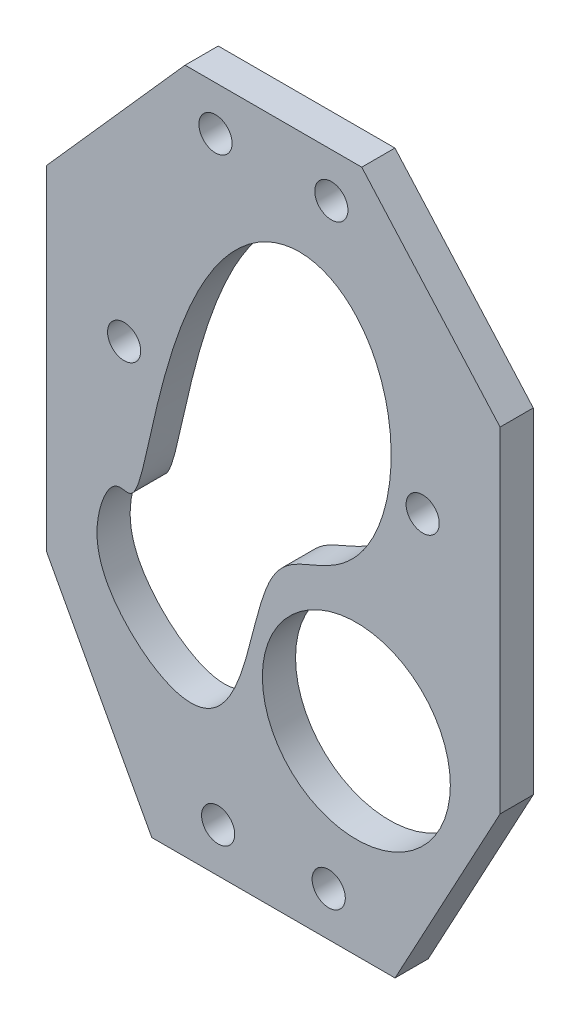
ISO-10303-21;
HEADER;
FILE_DESCRIPTION(('STEP AP214'),'2;1');
FILE_NAME('part.step','',(''),(''),'','','');
FILE_SCHEMA(('AUTOMOTIVE_DESIGN { 1 0 10303 214 1 1 1 1 }'));
ENDSEC;
DATA;
#1=APPLICATION_CONTEXT('core data for automotive mechanical design processes');
#2=APPLICATION_PROTOCOL_DEFINITION('international standard','automotive_design',2000,#1);
#3=PRODUCT_CONTEXT('',#1,'mechanical');
#4=PRODUCT('Part','Part','',(#3));
#5=PRODUCT_RELATED_PRODUCT_CATEGORY('part','',(#4));
#6=PRODUCT_DEFINITION_FORMATION('','',#4);
#7=PRODUCT_DEFINITION_CONTEXT('part definition',#1,'design');
#8=PRODUCT_DEFINITION('design','',#6,#7);
#9=PRODUCT_DEFINITION_SHAPE('','',#8);
#10=(LENGTH_UNIT() NAMED_UNIT(*) SI_UNIT(.MILLI.,.METRE.));
#11=(NAMED_UNIT(*) PLANE_ANGLE_UNIT() SI_UNIT($,.RADIAN.));
#12=(NAMED_UNIT(*) SI_UNIT($,.STERADIAN.) SOLID_ANGLE_UNIT());
#13=UNCERTAINTY_MEASURE_WITH_UNIT(LENGTH_MEASURE(1.E-05),#10,'distance_accuracy_value','');
#14=(GEOMETRIC_REPRESENTATION_CONTEXT(3) GLOBAL_UNCERTAINTY_ASSIGNED_CONTEXT((#13)) GLOBAL_UNIT_ASSIGNED_CONTEXT((#10,
#11,#12)) REPRESENTATION_CONTEXT('',''));
#15=CARTESIAN_POINT('',(0.,0.,0.));
#16=DIRECTION('',(0.,0.,1.));
#17=DIRECTION('',(1.,0.,0.));
#18=AXIS2_PLACEMENT_3D('',#15,#16,#17);
#19=CARTESIAN_POINT('',(-12.9886663653076,25.9697597618438,3.));
#20=CARTESIAN_POINT('',(-12.9886663653076,25.9697597618438,0.));
#21=CARTESIAN_POINT('',(-12.8811555510627,26.0082841727138,3.));
#22=CARTESIAN_POINT('',(-12.8811555510627,26.0082841727138,0.));
#23=CARTESIAN_POINT('',(-12.6711859167556,26.1424193813166,3.));
#24=CARTESIAN_POINT('',(-12.6711859167556,26.1424193813166,0.));
#25=CARTESIAN_POINT('',(-12.3690109144672,26.5664325253637,3.));
#26=CARTESIAN_POINT('',(-12.3690109144672,26.5664325253637,0.));
#27=CARTESIAN_POINT('',(-11.9726032784089,27.7137543443748,3.));
#28=CARTESIAN_POINT('',(-11.9726032784089,27.7137543443748,0.));
#29=CARTESIAN_POINT('',(-11.40835152261,30.1863828809206,3.));
#30=CARTESIAN_POINT('',(-11.40835152261,30.1863828809206,0.));
#31=CARTESIAN_POINT('',(-10.6796257984521,33.549588534079,3.));
#32=CARTESIAN_POINT('',(-10.6796257984521,33.549588534079,0.));
#33=CARTESIAN_POINT('',(-9.69036518643553,37.5033477056489,3.));
#34=CARTESIAN_POINT('',(-9.69036518643553,37.5033477056489,0.));
#35=CARTESIAN_POINT('',(-8.35971407224199,41.655109598364,3.));
#36=CARTESIAN_POINT('',(-8.35971407224199,41.655109598364,0.));
#37=CARTESIAN_POINT('',(-6.63830444128162,45.5820925783953,3.));
#38=CARTESIAN_POINT('',(-6.63830444128162,45.5820925783953,0.));
#39=CARTESIAN_POINT('',(-4.52299296953164,48.8897083417026,3.));
#40=CARTESIAN_POINT('',(-4.52299296953164,48.8897083417026,0.));
#41=CARTESIAN_POINT('',(-2.07562081179025,51.2777751125054,3.));
#42=CARTESIAN_POINT('',(-2.07562081179025,51.2777751125054,0.));
#43=CARTESIAN_POINT('',(0.56979497448884,52.5845568360423,3.));
#44=CARTESIAN_POINT('',(0.56979497448884,52.5845568360423,0.));
#45=CARTESIAN_POINT('',(3.23686993791042,52.7611936393988,3.));
#46=CARTESIAN_POINT('',(3.23686993791042,52.7611936393988,0.));
#47=CARTESIAN_POINT('',(5.7299504756089,51.8583025063584,3.));
#48=CARTESIAN_POINT('',(5.7299504756089,51.8583025063584,0.));
#49=CARTESIAN_POINT('',(7.86026806639607,50.008365963377,3.));
#50=CARTESIAN_POINT('',(7.86026806639607,50.008365963377,0.));
#51=CARTESIAN_POINT('',(9.46964085438705,47.4098354676913,3.));
#52=CARTESIAN_POINT('',(9.46964085438705,47.4098354676913,0.));
#53=CARTESIAN_POINT('',(10.4580835526336,44.3118105190223,3.));
#54=CARTESIAN_POINT('',(10.4580835526336,44.3118105190223,0.));
#55=CARTESIAN_POINT('',(10.8013693709001,40.9955389681143,3.));
#56=CARTESIAN_POINT('',(10.8013693709001,40.9955389681143,0.));
#57=CARTESIAN_POINT('',(10.5336979825187,37.7434612354341,3.));
#58=CARTESIAN_POINT('',(10.5336979825187,37.7434612354341,0.));
#59=CARTESIAN_POINT('',(9.73614896748045,34.8098067099323,3.));
#60=CARTESIAN_POINT('',(9.73614896748045,34.8098067099323,0.));
#61=CARTESIAN_POINT('',(8.52305586131837,32.3915891337557,3.));
#62=CARTESIAN_POINT('',(8.52305586131837,32.3915891337557,0.));
#63=CARTESIAN_POINT('',(7.02942960529987,30.5967967115499,3.));
#64=CARTESIAN_POINT('',(7.02942960529987,30.5967967115499,0.));
#65=CARTESIAN_POINT('',(5.39800980077467,29.4192203433074,3.));
#66=CARTESIAN_POINT('',(5.39800980077467,29.4192203433074,0.));
#67=CARTESIAN_POINT('',(3.76659043993026,28.6960978499696,3.));
#68=CARTESIAN_POINT('',(3.76659043993026,28.6960978499696,0.));
#69=CARTESIAN_POINT('',(2.25501495057952,28.1207498469256,3.));
#70=CARTESIAN_POINT('',(2.25501495057952,28.1207498469256,0.));
#71=CARTESIAN_POINT('',(0.951641484746782,27.351053666154,3.));
#72=CARTESIAN_POINT('',(0.951641484746782,27.351053666154,0.));
#73=CARTESIAN_POINT('',(-0.100059580647638,26.095667378239,3.));
#74=CARTESIAN_POINT('',(-0.100059580647638,26.095667378239,0.));
#75=CARTESIAN_POINT('',(-0.915342172913766,24.2101851711681,3.));
#76=CARTESIAN_POINT('',(-0.915342172913766,24.2101851711681,0.));
#77=CARTESIAN_POINT('',(-1.58138785116678,21.7870031884751,3.));
#78=CARTESIAN_POINT('',(-1.58138785116678,21.7870031884751,0.));
#79=CARTESIAN_POINT('',(-2.22735005416778,19.0804869004419,3.));
#80=CARTESIAN_POINT('',(-2.22735005416778,19.0804869004419,0.));
#81=CARTESIAN_POINT('',(-2.99516118605609,16.434513521141,3.));
#82=CARTESIAN_POINT('',(-2.99516118605609,16.434513521141,0.));
#83=CARTESIAN_POINT('',(-4.01024990311972,14.2097889669292,3.));
#84=CARTESIAN_POINT('',(-4.01024990311972,14.2097889669292,0.));
#85=CARTESIAN_POINT('',(-5.3519860119803,12.7108378216285,3.));
#86=CARTESIAN_POINT('',(-5.3519860119803,12.7108378216285,0.));
#87=CARTESIAN_POINT('',(-7.02476638668441,12.1143095662187,3.));
#88=CARTESIAN_POINT('',(-7.02476638668441,12.1143095662187,0.));
#89=CARTESIAN_POINT('',(-8.92676940833258,12.392733311816,3.));
#90=CARTESIAN_POINT('',(-8.92676940833258,12.392733311816,0.));
#91=CARTESIAN_POINT('',(-10.8888420515105,13.3778635537221,3.));
#92=CARTESIAN_POINT('',(-10.8888420515105,13.3778635537221,0.));
#93=CARTESIAN_POINT('',(-12.7157972989685,14.8289391864684,3.));
#94=CARTESIAN_POINT('',(-12.7157972989685,14.8289391864684,0.));
#95=CARTESIAN_POINT('',(-14.2263449887121,16.4978278027395,3.));
#96=CARTESIAN_POINT('',(-14.2263449887121,16.4978278027395,0.));
#97=CARTESIAN_POINT('',(-15.2944330919543,18.1976268551407,3.));
#98=CARTESIAN_POINT('',(-15.2944330919543,18.1976268551407,0.));
#99=CARTESIAN_POINT('',(-15.8878448569422,19.8638913245182,3.));
#100=CARTESIAN_POINT('',(-15.8878448569422,19.8638913245182,0.));
#101=CARTESIAN_POINT('',(-16.0433066175379,21.4910105028895,3.));
#102=CARTESIAN_POINT('',(-16.0433066175379,21.4910105028895,0.));
#103=CARTESIAN_POINT('',(-15.8437259664775,23.0636381489599,3.));
#104=CARTESIAN_POINT('',(-15.8437259664775,23.0636381489599,0.));
#105=CARTESIAN_POINT('',(-15.395625456899,24.5093810700771,3.));
#106=CARTESIAN_POINT('',(-15.395625456899,24.5093810700771,0.));
#107=CARTESIAN_POINT('',(-14.8046246417499,25.5947568342229,3.));
#108=CARTESIAN_POINT('',(-14.8046246417499,25.5947568342229,0.));
#109=CARTESIAN_POINT('',(-14.1624284528697,26.0840799509932,3.));
#110=CARTESIAN_POINT('',(-14.1624284528697,26.0840799509932,0.));
#111=CARTESIAN_POINT('',(-13.6638937521533,26.001037253806,3.));
#112=CARTESIAN_POINT('',(-13.6638937521533,26.001037253806,0.));
#113=CARTESIAN_POINT('',(-13.316250802225,25.9112729160967,3.));
#114=CARTESIAN_POINT('',(-13.316250802225,25.9112729160967,0.));
#115=CARTESIAN_POINT('',(-13.0961771795525,25.9312353509739,3.));
#116=CARTESIAN_POINT('',(-13.0961771795525,25.9312353509739,0.));
#117=CARTESIAN_POINT('',(-12.9886663653076,25.9697597618438,3.));
#118=CARTESIAN_POINT('',(-12.9886663653076,25.9697597618438,0.));
#119=(BOUNDED_SURFACE() B_SPLINE_SURFACE(5,1,((#19,#20),(#21,#22),(#23,#24),(#25,#26),(#27,#28),
(#29,#30),(#31,#32),(#33,#34),(#35,#36),(#37,#38),(#39,#40),(#41,#42),(#43,#44),(#45,#46),(#47,
#48),(#49,#50),(#51,#52),(#53,#54),(#55,#56),(#57,#58),(#59,#60),(#61,#62),(#63,#64),(#65,#66),
(#67,#68),(#69,#70),(#71,#72),(#73,#74),(#75,#76),(#77,#78),(#79,#80),(#81,#82),(#83,#84),(#85,
#86),(#87,#88),(#89,#90),(#91,#92),(#93,#94),(#95,#96),(#97,#98),(#99,#100),(#101,#102),(#103,
#104),(#105,#106),(#107,#108),(#109,#110),(#111,#112),(#113,#114),(#115,#116),(#117,#118)),
.UNSPECIFIED.,.T.,.F.,.F.) B_SPLINE_SURFACE_WITH_KNOTS((6,1,1,1,1,1,1,1,1,1,1,1,1,1,1,1,1,1,1,1,
1,1,1,1,1,1,1,1,1,1,1,1,1,1,1,1,1,1,1,1,1,1,1,1,1,6),(2,2),(0.,0.0222222222222222,
0.0444444444444444,0.0666666666666667,0.0888888888888889,0.111111111111111,0.133333333333333,
0.155555555555556,0.177777777777778,0.2,0.222222222222222,0.244444444444444,0.266666666666667,
0.288888888888889,0.311111111111111,0.333333333333333,0.355555555555555,0.377777777777778,0.4,
0.422222222222222,0.444444444444444,0.466666666666666,0.488888888888889,0.511111111111111,
0.533333333333333,0.555555555555555,0.577777777777778,0.6,0.622222222222222,0.644444444444444,
0.666666666666667,0.688888888888889,0.711111111111111,0.733333333333333,0.755555555555556,
0.777777777777778,0.8,0.822222222222222,0.844444444444445,0.866666666666667,0.888888888888889,
0.911111111111111,0.933333333333334,0.955555555555556,0.977777777777778,1.),(0.,0.3),
.UNSPECIFIED.) GEOMETRIC_REPRESENTATION_ITEM() RATIONAL_B_SPLINE_SURFACE(((1.,1.),(1.,1.),(1.,
1.),(1.,1.),(1.,1.),(1.,1.),(1.,1.),(1.,1.),(1.,1.),(1.,1.),(1.,1.),(1.,1.),(1.,1.),(1.,1.),(1.,
1.),(1.,1.),(1.,1.),(1.,1.),(1.,1.),(1.,1.),(1.,1.),(1.,1.),(1.,1.),(1.,1.),(1.,1.),(1.,1.),(1.,
1.),(1.,1.),(1.,1.),(1.,1.),(1.,1.),(1.,1.),(1.,1.),(1.,1.),(1.,1.),(1.,1.),(1.,1.),(1.,1.),(1.,
1.),(1.,1.),(1.,1.),(1.,1.),(1.,1.),(1.,1.),(1.,1.),(1.,1.),(1.,1.),(1.,1.),(1.,1.),(1.,1.))) REPRESENTATION_ITEM('') SURFACE());
#120=CARTESIAN_POINT('',(-12.9886663653076,25.9697597618438,3.));
#121=CARTESIAN_POINT('',(-12.8811555510627,26.0082841727138,3.));
#122=CARTESIAN_POINT('',(-12.6711859167556,26.1424193813166,3.));
#123=CARTESIAN_POINT('',(-12.3690109144672,26.5664325253637,3.));
#124=CARTESIAN_POINT('',(-11.9726032784089,27.7137543443748,3.));
#125=CARTESIAN_POINT('',(-11.40835152261,30.1863828809206,3.));
#126=CARTESIAN_POINT('',(-10.6796257984521,33.549588534079,3.));
#127=CARTESIAN_POINT('',(-9.69036518643553,37.5033477056489,3.));
#128=CARTESIAN_POINT('',(-8.35971407224199,41.655109598364,3.));
#129=CARTESIAN_POINT('',(-6.63830444128162,45.5820925783953,3.));
#130=CARTESIAN_POINT('',(-4.52299296953164,48.8897083417026,3.));
#131=CARTESIAN_POINT('',(-2.07562081179025,51.2777751125054,3.));
#132=CARTESIAN_POINT('',(0.56979497448884,52.5845568360423,3.));
#133=CARTESIAN_POINT('',(3.23686993791042,52.7611936393988,3.));
#134=CARTESIAN_POINT('',(5.7299504756089,51.8583025063584,3.));
#135=CARTESIAN_POINT('',(7.86026806639607,50.008365963377,3.));
#136=CARTESIAN_POINT('',(9.46964085438705,47.4098354676913,3.));
#137=CARTESIAN_POINT('',(10.4580835526336,44.3118105190223,3.));
#138=CARTESIAN_POINT('',(10.8013693709001,40.9955389681143,3.));
#139=CARTESIAN_POINT('',(10.5336979825187,37.7434612354341,3.));
#140=CARTESIAN_POINT('',(9.73614896748045,34.8098067099323,3.));
#141=CARTESIAN_POINT('',(8.52305586131837,32.3915891337557,3.));
#142=CARTESIAN_POINT('',(7.02942960529987,30.5967967115499,3.));
#143=CARTESIAN_POINT('',(5.39800980077467,29.4192203433074,3.));
#144=CARTESIAN_POINT('',(3.76659043993026,28.6960978499696,3.));
#145=CARTESIAN_POINT('',(2.25501495057952,28.1207498469256,3.));
#146=CARTESIAN_POINT('',(0.951641484746782,27.351053666154,3.));
#147=CARTESIAN_POINT('',(-0.100059580647638,26.095667378239,3.));
#148=CARTESIAN_POINT('',(-0.915342172913766,24.2101851711681,3.));
#149=CARTESIAN_POINT('',(-1.58138785116678,21.7870031884751,3.));
#150=CARTESIAN_POINT('',(-2.22735005416778,19.0804869004419,3.));
#151=CARTESIAN_POINT('',(-2.99516118605609,16.434513521141,3.));
#152=CARTESIAN_POINT('',(-4.01024990311972,14.2097889669292,3.));
#153=CARTESIAN_POINT('',(-5.3519860119803,12.7108378216285,3.));
#154=CARTESIAN_POINT('',(-7.02476638668441,12.1143095662187,3.));
#155=CARTESIAN_POINT('',(-8.92676940833258,12.392733311816,3.));
#156=CARTESIAN_POINT('',(-10.8888420515105,13.3778635537221,3.));
#157=CARTESIAN_POINT('',(-12.7157972989685,14.8289391864684,3.));
#158=CARTESIAN_POINT('',(-14.2263449887121,16.4978278027395,3.));
#159=CARTESIAN_POINT('',(-15.2944330919543,18.1976268551407,3.));
#160=CARTESIAN_POINT('',(-15.8878448569422,19.8638913245182,3.));
#161=CARTESIAN_POINT('',(-16.0433066175379,21.4910105028895,3.));
#162=CARTESIAN_POINT('',(-15.8437259664775,23.0636381489599,3.));
#163=CARTESIAN_POINT('',(-15.395625456899,24.5093810700771,3.));
#164=CARTESIAN_POINT('',(-14.8046246417499,25.5947568342229,3.));
#165=CARTESIAN_POINT('',(-14.1624284528697,26.0840799509932,3.));
#166=CARTESIAN_POINT('',(-13.6638937521533,26.001037253806,3.));
#167=CARTESIAN_POINT('',(-13.316250802225,25.9112729160967,3.));
#168=CARTESIAN_POINT('',(-13.0961771795525,25.9312353509739,3.));
#169=CARTESIAN_POINT('',(-12.9886663653076,25.9697597618438,3.));
#170=(BOUNDED_CURVE() B_SPLINE_CURVE(5,(#120,#121,#122,#123,#124,#125,#126,#127,#128,#129,#130,
#131,#132,#133,#134,#135,#136,#137,#138,#139,#140,#141,#142,#143,#144,#145,#146,#147,#148,#149,
#150,#151,#152,#153,#154,#155,#156,#157,#158,#159,#160,#161,#162,#163,#164,#165,#166,#167,#168,
#169),.UNSPECIFIED.,.T.,.F.) B_SPLINE_CURVE_WITH_KNOTS((6,1,1,1,1,1,1,1,1,1,1,1,1,1,1,1,1,1,1,1,
1,1,1,1,1,1,1,1,1,1,1,1,1,1,1,1,1,1,1,1,1,1,1,1,1,6),(0.,0.0222222222222222,0.0444444444444444,
0.0666666666666667,0.0888888888888889,0.111111111111111,0.133333333333333,0.155555555555556,
0.177777777777778,0.2,0.222222222222222,0.244444444444444,0.266666666666667,0.288888888888889,
0.311111111111111,0.333333333333333,0.355555555555555,0.377777777777778,0.4,0.422222222222222,
0.444444444444444,0.466666666666666,0.488888888888889,0.511111111111111,0.533333333333333,
0.555555555555555,0.577777777777778,0.6,0.622222222222222,0.644444444444444,0.666666666666667,
0.688888888888889,0.711111111111111,0.733333333333333,0.755555555555556,0.777777777777778,0.8,
0.822222222222222,0.844444444444445,0.866666666666667,0.888888888888889,0.911111111111111,
0.933333333333334,0.955555555555556,0.977777777777778,1.),
.UNSPECIFIED.) CURVE() GEOMETRIC_REPRESENTATION_ITEM() RATIONAL_B_SPLINE_CURVE((1.,1.,1.,1.,1.,
1.,1.,1.,1.,1.,1.,1.,1.,1.,1.,1.,1.,1.,1.,1.,1.,1.,1.,1.,1.,1.,1.,1.,1.,1.,1.,1.,1.,1.,1.,1.,1.,
1.,1.,1.,1.,1.,1.,1.,1.,1.,1.,1.,1.,1.)) REPRESENTATION_ITEM(''));
#171=CARTESIAN_POINT('',(-12.9886663653076,25.9697597618438,3.));
#172=VERTEX_POINT('',#171);
#173=EDGE_CURVE('E61',#172,#172,#170,.T.);
#174=DIRECTION('',(0.,0.,-1.));
#175=VECTOR('',#174,1.);
#176=CARTESIAN_POINT('',(-12.9886663653076,25.9697597618438,3.));
#177=LINE('',#176,#175);
#178=CARTESIAN_POINT('',(-12.9886663653076,25.9697597618438,0.));
#179=VERTEX_POINT('',#178);
#180=EDGE_CURVE('E11',#172,#179,#177,.T.);
#181=CARTESIAN_POINT('',(-12.9886663653076,25.9697597618438,0.));
#182=CARTESIAN_POINT('',(-13.0961771795525,25.9312353509739,0.));
#183=CARTESIAN_POINT('',(-13.316250802225,25.9112729160967,0.));
#184=CARTESIAN_POINT('',(-13.6638937521533,26.001037253806,0.));
#185=CARTESIAN_POINT('',(-14.1624284528697,26.0840799509932,0.));
#186=CARTESIAN_POINT('',(-14.8046246417499,25.5947568342229,0.));
#187=CARTESIAN_POINT('',(-15.395625456899,24.5093810700771,0.));
#188=CARTESIAN_POINT('',(-15.8437259664775,23.0636381489599,0.));
#189=CARTESIAN_POINT('',(-16.0433066175379,21.4910105028895,0.));
#190=CARTESIAN_POINT('',(-15.8878448569422,19.8638913245182,0.));
#191=CARTESIAN_POINT('',(-15.2944330919543,18.1976268551407,0.));
#192=CARTESIAN_POINT('',(-14.2263449887121,16.4978278027395,0.));
#193=CARTESIAN_POINT('',(-12.7157972989685,14.8289391864684,0.));
#194=CARTESIAN_POINT('',(-10.8888420515105,13.3778635537221,0.));
#195=CARTESIAN_POINT('',(-8.92676940833258,12.392733311816,0.));
#196=CARTESIAN_POINT('',(-7.02476638668441,12.1143095662187,0.));
#197=CARTESIAN_POINT('',(-5.3519860119803,12.7108378216285,0.));
#198=CARTESIAN_POINT('',(-4.01024990311972,14.2097889669292,0.));
#199=CARTESIAN_POINT('',(-2.99516118605609,16.434513521141,0.));
#200=CARTESIAN_POINT('',(-2.22735005416778,19.0804869004419,0.));
#201=CARTESIAN_POINT('',(-1.58138785116678,21.7870031884751,0.));
#202=CARTESIAN_POINT('',(-0.915342172913766,24.2101851711681,0.));
#203=CARTESIAN_POINT('',(-0.100059580647638,26.095667378239,0.));
#204=CARTESIAN_POINT('',(0.951641484746782,27.351053666154,0.));
#205=CARTESIAN_POINT('',(2.25501495057952,28.1207498469256,0.));
#206=CARTESIAN_POINT('',(3.76659043993026,28.6960978499696,0.));
#207=CARTESIAN_POINT('',(5.39800980077467,29.4192203433074,0.));
#208=CARTESIAN_POINT('',(7.02942960529987,30.5967967115499,0.));
#209=CARTESIAN_POINT('',(8.52305586131837,32.3915891337557,0.));
#210=CARTESIAN_POINT('',(9.73614896748045,34.8098067099323,0.));
#211=CARTESIAN_POINT('',(10.5336979825187,37.7434612354341,0.));
#212=CARTESIAN_POINT('',(10.8013693709001,40.9955389681143,0.));
#213=CARTESIAN_POINT('',(10.4580835526336,44.3118105190223,0.));
#214=CARTESIAN_POINT('',(9.46964085438705,47.4098354676913,0.));
#215=CARTESIAN_POINT('',(7.86026806639607,50.008365963377,0.));
#216=CARTESIAN_POINT('',(5.7299504756089,51.8583025063584,0.));
#217=CARTESIAN_POINT('',(3.23686993791042,52.7611936393988,0.));
#218=CARTESIAN_POINT('',(0.56979497448884,52.5845568360423,0.));
#219=CARTESIAN_POINT('',(-2.07562081179025,51.2777751125054,0.));
#220=CARTESIAN_POINT('',(-4.52299296953164,48.8897083417026,0.));
#221=CARTESIAN_POINT('',(-6.63830444128162,45.5820925783953,0.));
#222=CARTESIAN_POINT('',(-8.35971407224199,41.655109598364,0.));
#223=CARTESIAN_POINT('',(-9.69036518643553,37.5033477056489,0.));
#224=CARTESIAN_POINT('',(-10.6796257984521,33.549588534079,0.));
#225=CARTESIAN_POINT('',(-11.40835152261,30.1863828809206,0.));
#226=CARTESIAN_POINT('',(-11.9726032784089,27.7137543443748,0.));
#227=CARTESIAN_POINT('',(-12.3690109144672,26.5664325253637,0.));
#228=CARTESIAN_POINT('',(-12.6711859167556,26.1424193813166,0.));
#229=CARTESIAN_POINT('',(-12.8811555510627,26.0082841727138,0.));
#230=CARTESIAN_POINT('',(-12.9886663653076,25.9697597618438,0.));
#231=(BOUNDED_CURVE() B_SPLINE_CURVE(5,(#181,#182,#183,#184,#185,#186,#187,#188,#189,#190,#191,
#192,#193,#194,#195,#196,#197,#198,#199,#200,#201,#202,#203,#204,#205,#206,#207,#208,#209,#210,
#211,#212,#213,#214,#215,#216,#217,#218,#219,#220,#221,#222,#223,#224,#225,#226,#227,#228,#229,
#230),.UNSPECIFIED.,.T.,.F.) B_SPLINE_CURVE_WITH_KNOTS((6,1,1,1,1,1,1,1,1,1,1,1,1,1,1,1,1,1,1,1,
1,1,1,1,1,1,1,1,1,1,1,1,1,1,1,1,1,1,1,1,1,1,1,1,1,6),(-1.,-0.977777777777778,-0.955555555555556,
-0.933333333333334,-0.911111111111111,-0.888888888888889,-0.866666666666667,-0.844444444444445,
-0.822222222222222,-0.8,-0.777777777777778,-0.755555555555556,-0.733333333333333,
-0.711111111111111,-0.688888888888889,-0.666666666666667,-0.644444444444444,-0.622222222222222,
-0.6,-0.577777777777778,-0.555555555555555,-0.533333333333333,-0.511111111111111,
-0.488888888888889,-0.466666666666666,-0.444444444444444,-0.422222222222222,-0.4,
-0.377777777777778,-0.355555555555555,-0.333333333333333,-0.311111111111111,-0.288888888888889,
-0.266666666666667,-0.244444444444444,-0.222222222222222,-0.2,-0.177777777777778,
-0.155555555555556,-0.133333333333333,-0.111111111111111,-0.0888888888888889,
-0.0666666666666667,-0.0444444444444444,-0.0222222222222222,0.),
.UNSPECIFIED.) CURVE() GEOMETRIC_REPRESENTATION_ITEM() RATIONAL_B_SPLINE_CURVE((1.,1.,1.,1.,1.,
1.,1.,1.,1.,1.,1.,1.,1.,1.,1.,1.,1.,1.,1.,1.,1.,1.,1.,1.,1.,1.,1.,1.,1.,1.,1.,1.,1.,1.,1.,1.,1.,
1.,1.,1.,1.,1.,1.,1.,1.,1.,1.,1.,1.,1.)) REPRESENTATION_ITEM(''));
#232=EDGE_CURVE('E302',#179,#179,#231,.T.);
#233=ORIENTED_EDGE('',*,*,#173,.F.);
#234=ORIENTED_EDGE('',*,*,#180,.T.);
#235=ORIENTED_EDGE('',*,*,#232,.F.);
#236=ORIENTED_EDGE('',*,*,#180,.F.);
#237=EDGE_LOOP('',(#233,#234,#235,#236));
#238=FACE_BOUND('',#237,.T.);
#239=ADVANCED_FACE('F38',(#238),#119,.F.);
#240=CARTESIAN_POINT('',(13.5,37.599715906798,0.));
#241=DIRECTION('',(0.,0.,1.));
#242=DIRECTION('',(1.,0.,0.));
#243=AXIS2_PLACEMENT_3D('',#240,#241,#242);
#244=CYLINDRICAL_SURFACE('',#243,1.5);
#245=CARTESIAN_POINT('',(13.5,37.599715906798,3.));
#246=DIRECTION('',(0.,0.,-1.));
#247=DIRECTION('',(1.,0.,0.));
#248=AXIS2_PLACEMENT_3D('',#245,#246,#247);
#249=CIRCLE('',#248,1.5);
#250=CARTESIAN_POINT('',(12.,37.599715906798,3.));
#251=VERTEX_POINT('',#250);
#252=EDGE_CURVE('E230',#251,#251,#249,.T.);
#253=ORIENTED_EDGE('',*,*,#252,.F.);
#254=DIRECTION('',(0.,0.,-1.));
#255=VECTOR('',#254,1.);
#256=CARTESIAN_POINT('',(12.,37.599715906798,0.));
#257=LINE('',#256,#255);
#258=CARTESIAN_POINT('',(12.,37.599715906798,0.));
#259=VERTEX_POINT('',#258);
#260=EDGE_CURVE('E49',#251,#259,#257,.T.);
#261=ORIENTED_EDGE('',*,*,#260,.T.);
#262=CARTESIAN_POINT('',(13.5,37.599715906798,0.));
#263=DIRECTION('',(0.,0.,-1.));
#264=DIRECTION('',(1.,0.,0.));
#265=AXIS2_PLACEMENT_3D('',#262,#263,#264);
#266=CIRCLE('',#265,1.5);
#267=EDGE_CURVE('E251',#259,#259,#266,.T.);
#268=ORIENTED_EDGE('',*,*,#267,.T.);
#269=ORIENTED_EDGE('',*,*,#260,.F.);
#270=EDGE_LOOP('',(#253,#261,#268,#269));
#271=FACE_BOUND('',#270,.T.);
#272=ADVANCED_FACE('F384',(#271),#244,.F.);
#273=CARTESIAN_POINT('',(5.23982460190923,58.,0.));
#274=DIRECTION('',(0.,0.,1.));
#275=DIRECTION('',(1.,0.,0.));
#276=AXIS2_PLACEMENT_3D('',#273,#274,#275);
#277=CYLINDRICAL_SURFACE('',#276,1.5);
#278=CARTESIAN_POINT('',(5.23982460190923,58.,3.));
#279=DIRECTION('',(0.,0.,-1.));
#280=DIRECTION('',(1.,0.,0.));
#281=AXIS2_PLACEMENT_3D('',#278,#279,#280);
#282=CIRCLE('',#281,1.5);
#283=CARTESIAN_POINT('',(3.73982460190923,58.,3.));
#284=VERTEX_POINT('',#283);
#285=EDGE_CURVE('E234',#284,#284,#282,.T.);
#286=ORIENTED_EDGE('',*,*,#285,.F.);
#287=DIRECTION('',(0.,0.,-1.));
#288=VECTOR('',#287,1.);
#289=CARTESIAN_POINT('',(3.73982460190923,58.,0.));
#290=LINE('',#289,#288);
#291=CARTESIAN_POINT('',(3.73982460190923,58.,0.));
#292=VERTEX_POINT('',#291);
#293=EDGE_CURVE('E247',#284,#292,#290,.T.);
#294=ORIENTED_EDGE('',*,*,#293,.T.);
#295=CARTESIAN_POINT('',(5.23982460190923,58.,0.));
#296=DIRECTION('',(0.,0.,-1.));
#297=DIRECTION('',(1.,0.,0.));
#298=AXIS2_PLACEMENT_3D('',#295,#296,#297);
#299=CIRCLE('',#298,1.5);
#300=EDGE_CURVE('E252',#292,#292,#299,.T.);
#301=ORIENTED_EDGE('',*,*,#300,.T.);
#302=ORIENTED_EDGE('',*,*,#293,.F.);
#303=EDGE_LOOP('',(#286,#294,#301,#302));
#304=FACE_BOUND('',#303,.T.);
#305=ADVANCED_FACE('F398',(#304),#277,.F.);
#306=CARTESIAN_POINT('',(7.5,17.599715906798,0.));
#307=DIRECTION('',(0.,0.,1.));
#308=DIRECTION('',(1.,0.,0.));
#309=AXIS2_PLACEMENT_3D('',#306,#307,#308);
#310=CYLINDRICAL_SURFACE('',#309,8.5);
#311=CARTESIAN_POINT('',(7.5,17.599715906798,3.));
#312=DIRECTION('',(0.,0.,-1.));
#313=DIRECTION('',(1.,0.,0.));
#314=AXIS2_PLACEMENT_3D('',#311,#312,#313);
#315=CIRCLE('',#314,8.5);
#316=CARTESIAN_POINT('',(-1.,17.599715906798,3.));
#317=VERTEX_POINT('',#316);
#318=EDGE_CURVE('E258',#317,#317,#315,.T.);
#319=ORIENTED_EDGE('',*,*,#318,.F.);
#320=DIRECTION('',(0.,0.,-1.));
#321=VECTOR('',#320,1.);
#322=CARTESIAN_POINT('',(-1.,17.599715906798,0.));
#323=LINE('',#322,#321);
#324=CARTESIAN_POINT('',(-1.,17.599715906798,0.));
#325=VERTEX_POINT('',#324);
#326=EDGE_CURVE('E291',#317,#325,#323,.T.);
#327=ORIENTED_EDGE('',*,*,#326,.T.);
#328=CARTESIAN_POINT('',(7.5,17.599715906798,0.));
#329=DIRECTION('',(0.,0.,-1.));
#330=DIRECTION('',(1.,0.,0.));
#331=AXIS2_PLACEMENT_3D('',#328,#329,#330);
#332=CIRCLE('',#331,8.5);
#333=EDGE_CURVE('E295',#325,#325,#332,.T.);
#334=ORIENTED_EDGE('',*,*,#333,.T.);
#335=ORIENTED_EDGE('',*,*,#326,.F.);
#336=EDGE_LOOP('',(#319,#327,#334,#335));
#337=FACE_BOUND('',#336,.T.);
#338=ADVANCED_FACE('F444',(#337),#310,.F.);
#339=CARTESIAN_POINT('',(5.,4.,0.));
#340=DIRECTION('',(0.,0.,1.));
#341=DIRECTION('',(1.,0.,0.));
#342=AXIS2_PLACEMENT_3D('',#339,#340,#341);
#343=CYLINDRICAL_SURFACE('',#342,1.5);
#344=CARTESIAN_POINT('',(5.,4.,3.));
#345=DIRECTION('',(0.,0.,-1.));
#346=DIRECTION('',(1.,0.,0.));
#347=AXIS2_PLACEMENT_3D('',#344,#345,#346);
#348=CIRCLE('',#347,1.5);
#349=CARTESIAN_POINT('',(3.5,4.,3.));
#350=VERTEX_POINT('',#349);
#351=EDGE_CURVE('E253',#350,#350,#348,.T.);
#352=ORIENTED_EDGE('',*,*,#351,.F.);
#353=DIRECTION('',(0.,0.,-1.));
#354=VECTOR('',#353,1.);
#355=CARTESIAN_POINT('',(3.5,4.,0.));
#356=LINE('',#355,#354);
#357=CARTESIAN_POINT('',(3.5,4.,0.));
#358=VERTEX_POINT('',#357);
#359=EDGE_CURVE('E275',#350,#358,#356,.T.);
#360=ORIENTED_EDGE('',*,*,#359,.T.);
#361=CARTESIAN_POINT('',(5.,4.,0.));
#362=DIRECTION('',(0.,0.,-1.));
#363=DIRECTION('',(1.,0.,0.));
#364=AXIS2_PLACEMENT_3D('',#361,#362,#363);
#365=CIRCLE('',#364,1.5);
#366=EDGE_CURVE('E271',#358,#358,#365,.T.);
#367=ORIENTED_EDGE('',*,*,#366,.T.);
#368=ORIENTED_EDGE('',*,*,#359,.F.);
#369=EDGE_LOOP('',(#352,#360,#367,#368));
#370=FACE_BOUND('',#369,.T.);
#371=ADVANCED_FACE('F449',(#370),#343,.F.);
#372=CARTESIAN_POINT('',(-13.5,37.599715906798,0.));
#373=DIRECTION('',(0.,0.,1.));
#374=DIRECTION('',(1.,0.,0.));
#375=AXIS2_PLACEMENT_3D('',#372,#373,#374);
#376=CYLINDRICAL_SURFACE('',#375,1.5);
#377=CARTESIAN_POINT('',(-13.5,37.599715906798,3.));
#378=DIRECTION('',(0.,0.,-1.));
#379=DIRECTION('',(1.,0.,0.));
#380=AXIS2_PLACEMENT_3D('',#377,#378,#379);
#381=CIRCLE('',#380,1.5);
#382=CARTESIAN_POINT('',(-15.,37.599715906798,3.));
#383=VERTEX_POINT('',#382);
#384=EDGE_CURVE('E257',#383,#383,#381,.T.);
#385=ORIENTED_EDGE('',*,*,#384,.F.);
#386=DIRECTION('',(0.,0.,-1.));
#387=VECTOR('',#386,1.);
#388=CARTESIAN_POINT('',(-15.,37.599715906798,0.));
#389=LINE('',#388,#387);
#390=CARTESIAN_POINT('',(-15.,37.599715906798,0.));
#391=VERTEX_POINT('',#390);
#392=EDGE_CURVE('E276',#383,#391,#389,.T.);
#393=ORIENTED_EDGE('',*,*,#392,.T.);
#394=CARTESIAN_POINT('',(-13.5,37.599715906798,0.));
#395=DIRECTION('',(0.,0.,-1.));
#396=DIRECTION('',(1.,0.,0.));
#397=AXIS2_PLACEMENT_3D('',#394,#395,#396);
#398=CIRCLE('',#397,1.5);
#399=EDGE_CURVE('E228',#391,#391,#398,.T.);
#400=ORIENTED_EDGE('',*,*,#399,.T.);
#401=ORIENTED_EDGE('',*,*,#392,.F.);
#402=EDGE_LOOP('',(#385,#393,#400,#401));
#403=FACE_BOUND('',#402,.T.);
#404=ADVANCED_FACE('F455',(#403),#376,.F.);
#405=CARTESIAN_POINT('',(-5.23982460190923,58.,0.));
#406=DIRECTION('',(0.,0.,1.));
#407=DIRECTION('',(1.,0.,0.));
#408=AXIS2_PLACEMENT_3D('',#405,#406,#407);
#409=CYLINDRICAL_SURFACE('',#408,1.5);
#410=CARTESIAN_POINT('',(-5.23982460190923,58.,3.));
#411=DIRECTION('',(0.,0.,-1.));
#412=DIRECTION('',(1.,0.,0.));
#413=AXIS2_PLACEMENT_3D('',#410,#411,#412);
#414=CIRCLE('',#413,1.5);
#415=CARTESIAN_POINT('',(-6.73982460190923,58.,3.));
#416=VERTEX_POINT('',#415);
#417=EDGE_CURVE('E270',#416,#416,#414,.T.);
#418=ORIENTED_EDGE('',*,*,#417,.F.);
#419=DIRECTION('',(0.,0.,-1.));
#420=VECTOR('',#419,1.);
#421=CARTESIAN_POINT('',(-6.73982460190923,58.,0.));
#422=LINE('',#421,#420);
#423=CARTESIAN_POINT('',(-6.73982460190923,58.,0.));
#424=VERTEX_POINT('',#423);
#425=EDGE_CURVE('E224',#416,#424,#422,.T.);
#426=ORIENTED_EDGE('',*,*,#425,.T.);
#427=CARTESIAN_POINT('',(-5.23982460190923,58.,0.));
#428=DIRECTION('',(0.,0.,-1.));
#429=DIRECTION('',(1.,0.,0.));
#430=AXIS2_PLACEMENT_3D('',#427,#428,#429);
#431=CIRCLE('',#430,1.5);
#432=EDGE_CURVE('E229',#424,#424,#431,.T.);
#433=ORIENTED_EDGE('',*,*,#432,.T.);
#434=ORIENTED_EDGE('',*,*,#425,.F.);
#435=EDGE_LOOP('',(#418,#426,#433,#434));
#436=FACE_BOUND('',#435,.T.);
#437=ADVANCED_FACE('F453',(#436),#409,.F.);
#438=CARTESIAN_POINT('',(-5.,4.,0.));
#439=DIRECTION('',(0.,0.,1.));
#440=DIRECTION('',(1.,0.,0.));
#441=AXIS2_PLACEMENT_3D('',#438,#439,#440);
#442=CYLINDRICAL_SURFACE('',#441,1.5);
#443=CARTESIAN_POINT('',(-5.,4.,3.));
#444=DIRECTION('',(0.,0.,-1.));
#445=DIRECTION('',(1.,0.,0.));
#446=AXIS2_PLACEMENT_3D('',#443,#444,#445);
#447=CIRCLE('',#446,1.5);
#448=CARTESIAN_POINT('',(-6.5,4.,3.));
#449=VERTEX_POINT('',#448);
#450=EDGE_CURVE('E266',#449,#449,#447,.T.);
#451=ORIENTED_EDGE('',*,*,#450,.F.);
#452=DIRECTION('',(0.,0.,-1.));
#453=VECTOR('',#452,1.);
#454=CARTESIAN_POINT('',(-6.5,4.,0.));
#455=LINE('',#454,#453);
#456=CARTESIAN_POINT('',(-6.5,4.,0.));
#457=VERTEX_POINT('',#456);
#458=EDGE_CURVE('E262',#449,#457,#455,.T.);
#459=ORIENTED_EDGE('',*,*,#458,.T.);
#460=CARTESIAN_POINT('',(-5.,4.,0.));
#461=DIRECTION('',(0.,0.,-1.));
#462=DIRECTION('',(1.,0.,0.));
#463=AXIS2_PLACEMENT_3D('',#460,#461,#462);
#464=CIRCLE('',#463,1.5);
#465=EDGE_CURVE('E309',#457,#457,#464,.T.);
#466=ORIENTED_EDGE('',*,*,#465,.T.);
#467=ORIENTED_EDGE('',*,*,#458,.F.);
#468=EDGE_LOOP('',(#451,#459,#466,#467));
#469=FACE_BOUND('',#468,.T.);
#470=ADVANCED_FACE('F363',(#469),#442,.F.);
#471=CARTESIAN_POINT('',(7.98982460190923,62.,0.));
#472=DIRECTION('',(0.,1.,0.));
#473=DIRECTION('',(1.,0.,0.));
#474=AXIS2_PLACEMENT_3D('',#471,#472,#473);
#475=PLANE('',#474);
#476=DIRECTION('',(1.,0.,0.));
#477=VECTOR('',#476,1.);
#478=CARTESIAN_POINT('',(0.,62.,0.));
#479=LINE('',#478,#477);
#480=CARTESIAN_POINT('',(-7.98982460190923,62.,0.));
#481=VERTEX_POINT('',#480);
#482=CARTESIAN_POINT('',(7.98982460190923,62.,0.));
#483=VERTEX_POINT('',#482);
#484=EDGE_CURVE('E235',#481,#483,#479,.T.);
#485=ORIENTED_EDGE('',*,*,#484,.F.);
#486=DIRECTION('',(0.,0.,1.));
#487=VECTOR('',#486,1.);
#488=CARTESIAN_POINT('',(-7.98982460190923,62.,0.));
#489=LINE('',#488,#487);
#490=CARTESIAN_POINT('',(-7.98982460190923,62.,3.));
#491=VERTEX_POINT('',#490);
#492=EDGE_CURVE('E42',#481,#491,#489,.T.);
#493=ORIENTED_EDGE('',*,*,#492,.T.);
#494=DIRECTION('',(-1.,0.,0.));
#495=VECTOR('',#494,1.);
#496=CARTESIAN_POINT('',(0.,62.,3.));
#497=LINE('',#496,#495);
#498=CARTESIAN_POINT('',(7.98982460190924,62.,3.));
#499=VERTEX_POINT('',#498);
#500=EDGE_CURVE('E206',#499,#491,#497,.T.);
#501=ORIENTED_EDGE('',*,*,#500,.F.);
#502=DIRECTION('',(0.,0.,1.));
#503=VECTOR('',#502,1.);
#504=CARTESIAN_POINT('',(7.98982460190923,62.,0.));
#505=LINE('',#504,#503);
#506=EDGE_CURVE('E246',#483,#499,#505,.T.);
#507=ORIENTED_EDGE('',*,*,#506,.F.);
#508=EDGE_LOOP('',(#485,#493,#501,#507));
#509=FACE_BOUND('',#508,.T.);
#510=ADVANCED_FACE('F459',(#509),#475,.T.);
#511=CARTESIAN_POINT('',(20.5,47.899715906798,0.));
#512=DIRECTION('',(0.748025681336975,0.663669782392083,0.));
#513=DIRECTION('',(0.,0.,-1.));
#514=AXIS2_PLACEMENT_3D('',#511,#512,#513);
#515=PLANE('',#514);
#516=DIRECTION('',(0.663669782392083,-0.748025681336974,0.));
#517=VECTOR('',#516,1.);
#518=CARTESIAN_POINT('',(7.98982460190923,62.,0.));
#519=LINE('',#518,#517);
#520=CARTESIAN_POINT('',(20.5,47.899715906798,0.));
#521=VERTEX_POINT('',#520);
#522=EDGE_CURVE('E242',#483,#521,#519,.T.);
#523=ORIENTED_EDGE('',*,*,#522,.F.);
#524=ORIENTED_EDGE('',*,*,#506,.T.);
#525=DIRECTION('',(-0.663669782392083,0.748025681336974,0.));
#526=VECTOR('',#525,1.);
#527=CARTESIAN_POINT('',(7.98982460190923,62.,3.));
#528=LINE('',#527,#526);
#529=CARTESIAN_POINT('',(20.5,47.899715906798,3.));
#530=VERTEX_POINT('',#529);
#531=EDGE_CURVE('E319',#530,#499,#528,.T.);
#532=ORIENTED_EDGE('',*,*,#531,.F.);
#533=DIRECTION('',(0.,0.,1.));
#534=VECTOR('',#533,1.);
#535=CARTESIAN_POINT('',(20.5,47.899715906798,0.));
#536=LINE('',#535,#534);
#537=EDGE_CURVE('E239',#521,#530,#536,.T.);
#538=ORIENTED_EDGE('',*,*,#537,.F.);
#539=EDGE_LOOP('',(#523,#524,#532,#538));
#540=FACE_BOUND('',#539,.T.);
#541=ADVANCED_FACE('F471',(#540),#515,.T.);
#542=CARTESIAN_POINT('',(20.5,17.599715906798,0.));
#543=DIRECTION('',(1.,0.,0.));
#544=DIRECTION('',(0.,1.,0.));
#545=AXIS2_PLACEMENT_3D('',#542,#543,#544);
#546=PLANE('',#545);
#547=DIRECTION('',(0.,-1.,0.));
#548=VECTOR('',#547,1.);
#549=CARTESIAN_POINT('',(20.5,47.899715906798,0.));
#550=LINE('',#549,#548);
#551=CARTESIAN_POINT('',(20.5,17.599715906798,0.));
#552=VERTEX_POINT('',#551);
#553=EDGE_CURVE('E282',#521,#552,#550,.T.);
#554=ORIENTED_EDGE('',*,*,#553,.F.);
#555=ORIENTED_EDGE('',*,*,#537,.T.);
#556=DIRECTION('',(0.,1.,0.));
#557=VECTOR('',#556,1.);
#558=CARTESIAN_POINT('',(20.5,47.899715906798,3.));
#559=LINE('',#558,#557);
#560=CARTESIAN_POINT('',(20.5,17.599715906798,3.));
#561=VERTEX_POINT('',#560);
#562=EDGE_CURVE('E322',#561,#530,#559,.T.);
#563=ORIENTED_EDGE('',*,*,#562,.F.);
#564=DIRECTION('',(0.,0.,1.));
#565=VECTOR('',#564,1.);
#566=CARTESIAN_POINT('',(20.5,17.599715906798,0.));
#567=LINE('',#566,#565);
#568=EDGE_CURVE('E222',#552,#561,#567,.T.);
#569=ORIENTED_EDGE('',*,*,#568,.F.);
#570=EDGE_LOOP('',(#554,#555,#563,#569));
#571=FACE_BOUND('',#570,.T.);
#572=ADVANCED_FACE('F417',(#571),#546,.T.);
#573=CARTESIAN_POINT('',(11.,0.,0.));
#574=DIRECTION('',(0.879985795339902,-0.475,0.));
#575=DIRECTION('',(0.,0.,-1.));
#576=AXIS2_PLACEMENT_3D('',#573,#574,#575);
#577=PLANE('',#576);
#578=DIRECTION('',(-0.475,-0.879985795339902,0.));
#579=VECTOR('',#578,1.);
#580=CARTESIAN_POINT('',(20.5,17.599715906798,0.));
#581=LINE('',#580,#579);
#582=CARTESIAN_POINT('',(11.,0.,0.));
#583=VERTEX_POINT('',#582);
#584=EDGE_CURVE('E299',#552,#583,#581,.T.);
#585=ORIENTED_EDGE('',*,*,#584,.F.);
#586=ORIENTED_EDGE('',*,*,#568,.T.);
#587=DIRECTION('',(0.475,0.879985795339902,0.));
#588=VECTOR('',#587,1.);
#589=CARTESIAN_POINT('',(20.5,17.599715906798,3.));
#590=LINE('',#589,#588);
#591=CARTESIAN_POINT('',(11.,0.,3.));
#592=VERTEX_POINT('',#591);
#593=EDGE_CURVE('E330',#592,#561,#590,.T.);
#594=ORIENTED_EDGE('',*,*,#593,.F.);
#595=DIRECTION('',(0.,0.,1.));
#596=VECTOR('',#595,1.);
#597=CARTESIAN_POINT('',(11.,0.,0.));
#598=LINE('',#597,#596);
#599=EDGE_CURVE('E223',#583,#592,#598,.T.);
#600=ORIENTED_EDGE('',*,*,#599,.F.);
#601=EDGE_LOOP('',(#585,#586,#594,#600));
#602=FACE_BOUND('',#601,.T.);
#603=ADVANCED_FACE('F40',(#602),#577,.T.);
#604=CARTESIAN_POINT('',(-11.,0.,0.));
#605=DIRECTION('',(0.,-1.,0.));
#606=DIRECTION('',(0.,0.,-1.));
#607=AXIS2_PLACEMENT_3D('',#604,#605,#606);
#608=PLANE('',#607);
#609=DIRECTION('',(1.,0.,0.));
#610=VECTOR('',#609,1.);
#611=CARTESIAN_POINT('',(-11.,0.,0.));
#612=LINE('',#611,#610);
#613=CARTESIAN_POINT('',(-11.,0.,0.));
#614=VERTEX_POINT('',#613);
#615=EDGE_CURVE('E218',#614,#583,#612,.T.);
#616=ORIENTED_EDGE('',*,*,#615,.T.);
#617=ORIENTED_EDGE('',*,*,#599,.T.);
#618=DIRECTION('',(1.,0.,0.));
#619=VECTOR('',#618,1.);
#620=CARTESIAN_POINT('',(-11.,0.,3.));
#621=LINE('',#620,#619);
#622=CARTESIAN_POINT('',(-11.,0.,3.));
#623=VERTEX_POINT('',#622);
#624=EDGE_CURVE('E217',#623,#592,#621,.T.);
#625=ORIENTED_EDGE('',*,*,#624,.F.);
#626=DIRECTION('',(0.,0.,1.));
#627=VECTOR('',#626,1.);
#628=CARTESIAN_POINT('',(-11.,0.,0.));
#629=LINE('',#628,#627);
#630=EDGE_CURVE('E289',#614,#623,#629,.T.);
#631=ORIENTED_EDGE('',*,*,#630,.F.);
#632=EDGE_LOOP('',(#616,#617,#625,#631));
#633=FACE_BOUND('',#632,.T.);
#634=ADVANCED_FACE('F402',(#633),#608,.T.);
#635=CARTESIAN_POINT('',(-20.5,17.599715906798,0.));
#636=DIRECTION('',(-0.879985795339902,-0.475,0.));
#637=DIRECTION('',(-0.475,0.879985795339902,0.));
#638=AXIS2_PLACEMENT_3D('',#635,#636,#637);
#639=PLANE('',#638);
#640=DIRECTION('',(0.475,-0.879985795339902,0.));
#641=VECTOR('',#640,1.);
#642=CARTESIAN_POINT('',(-20.5,17.599715906798,0.));
#643=LINE('',#642,#641);
#644=CARTESIAN_POINT('',(-20.5,17.599715906798,0.));
#645=VERTEX_POINT('',#644);
#646=EDGE_CURVE('E286',#645,#614,#643,.T.);
#647=ORIENTED_EDGE('',*,*,#646,.T.);
#648=ORIENTED_EDGE('',*,*,#630,.T.);
#649=DIRECTION('',(0.475,-0.879985795339902,0.));
#650=VECTOR('',#649,1.);
#651=CARTESIAN_POINT('',(-20.5,17.599715906798,3.));
#652=LINE('',#651,#650);
#653=CARTESIAN_POINT('',(-20.5,17.599715906798,3.));
#654=VERTEX_POINT('',#653);
#655=EDGE_CURVE('E192',#654,#623,#652,.T.);
#656=ORIENTED_EDGE('',*,*,#655,.F.);
#657=DIRECTION('',(0.,0.,1.));
#658=VECTOR('',#657,1.);
#659=CARTESIAN_POINT('',(-20.5,17.599715906798,0.));
#660=LINE('',#659,#658);
#661=EDGE_CURVE('E186',#645,#654,#660,.T.);
#662=ORIENTED_EDGE('',*,*,#661,.F.);
#663=EDGE_LOOP('',(#647,#648,#656,#662));
#664=FACE_BOUND('',#663,.T.);
#665=ADVANCED_FACE('F409',(#664),#639,.T.);
#666=CARTESIAN_POINT('',(-20.5,47.899715906798,0.));
#667=DIRECTION('',(-1.,0.,0.));
#668=DIRECTION('',(0.,0.,1.));
#669=AXIS2_PLACEMENT_3D('',#666,#667,#668);
#670=PLANE('',#669);
#671=DIRECTION('',(0.,-1.,0.));
#672=VECTOR('',#671,1.);
#673=CARTESIAN_POINT('',(-20.5,47.899715906798,0.));
#674=LINE('',#673,#672);
#675=CARTESIAN_POINT('',(-20.5,47.899715906798,0.));
#676=VERTEX_POINT('',#675);
#677=EDGE_CURVE('E287',#676,#645,#674,.T.);
#678=ORIENTED_EDGE('',*,*,#677,.T.);
#679=ORIENTED_EDGE('',*,*,#661,.T.);
#680=DIRECTION('',(0.,-1.,0.));
#681=VECTOR('',#680,1.);
#682=CARTESIAN_POINT('',(-20.5,47.899715906798,3.));
#683=LINE('',#682,#681);
#684=CARTESIAN_POINT('',(-20.5,47.899715906798,3.));
#685=VERTEX_POINT('',#684);
#686=EDGE_CURVE('E180',#685,#654,#683,.T.);
#687=ORIENTED_EDGE('',*,*,#686,.F.);
#688=DIRECTION('',(0.,0.,1.));
#689=VECTOR('',#688,1.);
#690=CARTESIAN_POINT('',(-20.5,47.899715906798,0.));
#691=LINE('',#690,#689);
#692=EDGE_CURVE('E184',#676,#685,#691,.T.);
#693=ORIENTED_EDGE('',*,*,#692,.F.);
#694=EDGE_LOOP('',(#678,#679,#687,#693));
#695=FACE_BOUND('',#694,.T.);
#696=ADVANCED_FACE('F183',(#695),#670,.T.);
#697=CARTESIAN_POINT('',(-7.98982460190923,62.,0.));
#698=DIRECTION('',(-0.748025681336975,0.663669782392083,0.));
#699=DIRECTION('',(0.,0.,1.));
#700=AXIS2_PLACEMENT_3D('',#697,#698,#699);
#701=PLANE('',#700);
#702=DIRECTION('',(-0.663669782392083,-0.748025681336974,0.));
#703=VECTOR('',#702,1.);
#704=CARTESIAN_POINT('',(-7.98982460190923,62.,0.));
#705=LINE('',#704,#703);
#706=EDGE_CURVE('E200',#481,#676,#705,.T.);
#707=ORIENTED_EDGE('',*,*,#706,.T.);
#708=ORIENTED_EDGE('',*,*,#692,.T.);
#709=DIRECTION('',(-0.663669782392083,-0.748025681336974,0.));
#710=VECTOR('',#709,1.);
#711=CARTESIAN_POINT('',(-7.98982460190923,62.,3.));
#712=LINE('',#711,#710);
#713=EDGE_CURVE('E191',#491,#685,#712,.T.);
#714=ORIENTED_EDGE('',*,*,#713,.F.);
#715=ORIENTED_EDGE('',*,*,#492,.F.);
#716=EDGE_LOOP('',(#707,#708,#714,#715));
#717=FACE_BOUND('',#716,.T.);
#718=ADVANCED_FACE('F197',(#717),#701,.T.);
#719=CARTESIAN_POINT('',(0.,31.,3.));
#720=DIRECTION('',(0.,0.,1.));
#721=DIRECTION('',(1.,0.,0.));
#722=AXIS2_PLACEMENT_3D('',#719,#720,#721);
#723=PLANE('',#722);
#724=ORIENTED_EDGE('',*,*,#713,.T.);
#725=ORIENTED_EDGE('',*,*,#686,.T.);
#726=ORIENTED_EDGE('',*,*,#655,.T.);
#727=ORIENTED_EDGE('',*,*,#624,.T.);
#728=ORIENTED_EDGE('',*,*,#593,.T.);
#729=ORIENTED_EDGE('',*,*,#562,.T.);
#730=ORIENTED_EDGE('',*,*,#531,.T.);
#731=ORIENTED_EDGE('',*,*,#500,.T.);
#732=EDGE_LOOP('',(#724,#725,#726,#727,#728,#729,#730,#731));
#733=FACE_BOUND('',#732,.T.);
#734=ORIENTED_EDGE('',*,*,#173,.T.);
#735=EDGE_LOOP('',(#734));
#736=FACE_BOUND('',#735,.T.);
#737=ORIENTED_EDGE('',*,*,#450,.T.);
#738=EDGE_LOOP('',(#737));
#739=FACE_BOUND('',#738,.T.);
#740=ORIENTED_EDGE('',*,*,#417,.T.);
#741=EDGE_LOOP('',(#740));
#742=FACE_BOUND('',#741,.T.);
#743=ORIENTED_EDGE('',*,*,#384,.T.);
#744=EDGE_LOOP('',(#743));
#745=FACE_BOUND('',#744,.T.);
#746=ORIENTED_EDGE('',*,*,#351,.T.);
#747=EDGE_LOOP('',(#746));
#748=FACE_BOUND('',#747,.T.);
#749=ORIENTED_EDGE('',*,*,#318,.T.);
#750=EDGE_LOOP('',(#749));
#751=FACE_BOUND('',#750,.T.);
#752=ORIENTED_EDGE('',*,*,#285,.T.);
#753=EDGE_LOOP('',(#752));
#754=FACE_BOUND('',#753,.T.);
#755=ORIENTED_EDGE('',*,*,#252,.T.);
#756=EDGE_LOOP('',(#755));
#757=FACE_BOUND('',#756,.T.);
#758=ADVANCED_FACE('F203',(#733,#736,#739,#742,#745,#748,#751,#754,#757),#723,.T.);
#759=CARTESIAN_POINT('',(0.,31.,0.));
#760=DIRECTION('',(0.,0.,1.));
#761=DIRECTION('',(1.,0.,0.));
#762=AXIS2_PLACEMENT_3D('',#759,#760,#761);
#763=PLANE('',#762);
#764=ORIENTED_EDGE('',*,*,#706,.F.);
#765=ORIENTED_EDGE('',*,*,#484,.T.);
#766=ORIENTED_EDGE('',*,*,#522,.T.);
#767=ORIENTED_EDGE('',*,*,#553,.T.);
#768=ORIENTED_EDGE('',*,*,#584,.T.);
#769=ORIENTED_EDGE('',*,*,#615,.F.);
#770=ORIENTED_EDGE('',*,*,#646,.F.);
#771=ORIENTED_EDGE('',*,*,#677,.F.);
#772=EDGE_LOOP('',(#764,#765,#766,#767,#768,#769,#770,#771));
#773=FACE_BOUND('',#772,.T.);
#774=ORIENTED_EDGE('',*,*,#232,.T.);
#775=EDGE_LOOP('',(#774));
#776=FACE_BOUND('',#775,.T.);
#777=ORIENTED_EDGE('',*,*,#465,.F.);
#778=EDGE_LOOP('',(#777));
#779=FACE_BOUND('',#778,.T.);
#780=ORIENTED_EDGE('',*,*,#432,.F.);
#781=EDGE_LOOP('',(#780));
#782=FACE_BOUND('',#781,.T.);
#783=ORIENTED_EDGE('',*,*,#399,.F.);
#784=EDGE_LOOP('',(#783));
#785=FACE_BOUND('',#784,.T.);
#786=ORIENTED_EDGE('',*,*,#366,.F.);
#787=EDGE_LOOP('',(#786));
#788=FACE_BOUND('',#787,.T.);
#789=ORIENTED_EDGE('',*,*,#333,.F.);
#790=EDGE_LOOP('',(#789));
#791=FACE_BOUND('',#790,.T.);
#792=ORIENTED_EDGE('',*,*,#300,.F.);
#793=EDGE_LOOP('',(#792));
#794=FACE_BOUND('',#793,.T.);
#795=ORIENTED_EDGE('',*,*,#267,.F.);
#796=EDGE_LOOP('',(#795));
#797=FACE_BOUND('',#796,.T.);
#798=ADVANCED_FACE('F367',(#773,#776,#779,#782,#785,#788,#791,#794,#797),#763,.F.);
#799=CLOSED_SHELL('',(#239,#272,#305,#338,#371,#404,#437,#470,#510,#541,#572,#603,#634,#665,
#696,#718,#758,#798));
#800=MANIFOLD_SOLID_BREP('B2',#799);
#801=ADVANCED_BREP_SHAPE_REPRESENTATION('',(#18,#800),#14);
#802=SHAPE_DEFINITION_REPRESENTATION(#9,#801);
ENDSEC;
END-ISO-10303-21;
